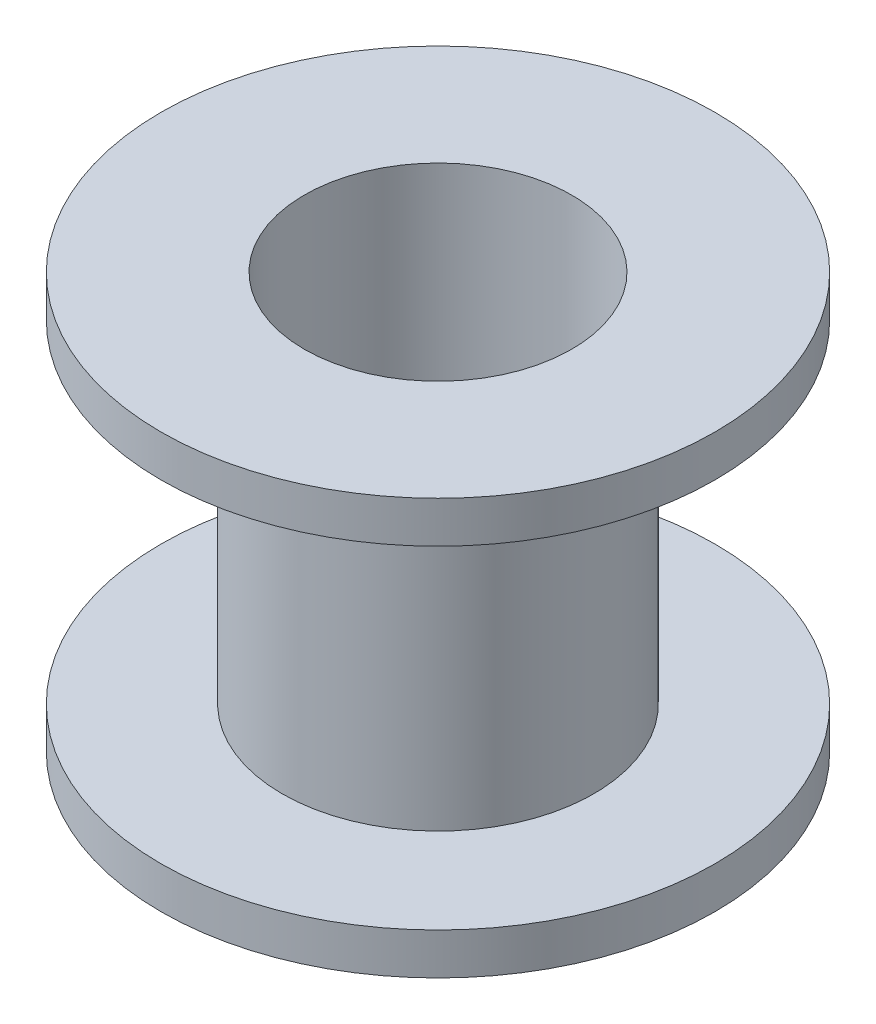
ISO-10303-21;
HEADER;
FILE_DESCRIPTION(('STEP AP214'),'2;1');
FILE_NAME('part.step','',(''),(''),'','','');
FILE_SCHEMA(('AUTOMOTIVE_DESIGN { 1 0 10303 214 1 1 1 1 }'));
ENDSEC;
DATA;
#1=APPLICATION_CONTEXT('core data for automotive mechanical design processes');
#2=APPLICATION_PROTOCOL_DEFINITION('international standard','automotive_design',2000,#1);
#3=PRODUCT_CONTEXT('',#1,'mechanical');
#4=PRODUCT('Part','Part','',(#3));
#5=PRODUCT_RELATED_PRODUCT_CATEGORY('part','',(#4));
#6=PRODUCT_DEFINITION_FORMATION('','',#4);
#7=PRODUCT_DEFINITION_CONTEXT('part definition',#1,'design');
#8=PRODUCT_DEFINITION('design','',#6,#7);
#9=PRODUCT_DEFINITION_SHAPE('','',#8);
#10=(LENGTH_UNIT() NAMED_UNIT(*) SI_UNIT(.MILLI.,.METRE.));
#11=(NAMED_UNIT(*) PLANE_ANGLE_UNIT() SI_UNIT($,.RADIAN.));
#12=(NAMED_UNIT(*) SI_UNIT($,.STERADIAN.) SOLID_ANGLE_UNIT());
#13=UNCERTAINTY_MEASURE_WITH_UNIT(LENGTH_MEASURE(1.E-05),#10,'distance_accuracy_value','');
#14=(GEOMETRIC_REPRESENTATION_CONTEXT(3) GLOBAL_UNCERTAINTY_ASSIGNED_CONTEXT((#13)) GLOBAL_UNIT_ASSIGNED_CONTEXT((#10,
#11,#12)) REPRESENTATION_CONTEXT('',''));
#15=CARTESIAN_POINT('',(0.,0.,0.));
#16=DIRECTION('',(0.,0.,1.));
#17=DIRECTION('',(1.,0.,0.));
#18=AXIS2_PLACEMENT_3D('',#15,#16,#17);
#19=CARTESIAN_POINT('',(0.,7.5,0.));
#20=DIRECTION('',(0.,-1.,0.));
#21=DIRECTION('',(0.,0.,-1.));
#22=AXIS2_PLACEMENT_3D('',#19,#20,#21);
#23=CYLINDRICAL_SURFACE('',#22,5.626);
#24=CARTESIAN_POINT('',(0.,6.,0.));
#25=DIRECTION('',(0.,1.,0.));
#26=DIRECTION('',(0.,0.,1.));
#27=AXIS2_PLACEMENT_3D('',#24,#25,#26);
#28=CIRCLE('',#27,5.626);
#29=CARTESIAN_POINT('',(0.,6.,5.626));
#30=VERTEX_POINT('',#29);
#31=EDGE_CURVE('E52',#30,#30,#28,.T.);
#32=ORIENTED_EDGE('',*,*,#31,.F.);
#33=EDGE_LOOP('',(#32));
#34=FACE_BOUND('',#33,.T.);
#35=CARTESIAN_POINT('',(0.,-6.,0.));
#36=DIRECTION('',(0.,-1.,0.));
#37=DIRECTION('',(0.,0.,-1.));
#38=AXIS2_PLACEMENT_3D('',#35,#36,#37);
#39=CIRCLE('',#38,5.626);
#40=CARTESIAN_POINT('',(0.,-6.,-5.626));
#41=VERTEX_POINT('',#40);
#42=EDGE_CURVE('E10',#41,#41,#39,.T.);
#43=ORIENTED_EDGE('',*,*,#42,.F.);
#44=EDGE_LOOP('',(#43));
#45=FACE_BOUND('',#44,.T.);
#46=ADVANCED_FACE('F45',(#34,#45),#23,.T.);
#47=CARTESIAN_POINT('',(0.,7.5,0.));
#48=DIRECTION('',(0.,1.,0.));
#49=DIRECTION('',(0.,0.,1.));
#50=AXIS2_PLACEMENT_3D('',#47,#48,#49);
#51=PLANE('',#50);
#52=CARTESIAN_POINT('',(0.,7.5,0.));
#53=DIRECTION('',(0.,1.,0.));
#54=DIRECTION('',(0.,0.,1.));
#55=AXIS2_PLACEMENT_3D('',#52,#53,#54);
#56=CIRCLE('',#55,4.826);
#57=CARTESIAN_POINT('',(0.,7.5,4.826));
#58=VERTEX_POINT('',#57);
#59=EDGE_CURVE('E57',#58,#58,#56,.T.);
#60=ORIENTED_EDGE('',*,*,#59,.F.);
#61=EDGE_LOOP('',(#60));
#62=FACE_BOUND('',#61,.T.);
#63=CARTESIAN_POINT('',(0.,7.5,0.));
#64=DIRECTION('',(0.,1.,0.));
#65=DIRECTION('',(0.,0.,1.));
#66=AXIS2_PLACEMENT_3D('',#63,#64,#65);
#67=CIRCLE('',#66,10.);
#68=CARTESIAN_POINT('',(0.,7.5,10.));
#69=VERTEX_POINT('',#68);
#70=EDGE_CURVE('E69',#69,#69,#67,.T.);
#71=ORIENTED_EDGE('',*,*,#70,.T.);
#72=EDGE_LOOP('',(#71));
#73=FACE_BOUND('',#72,.T.);
#74=ADVANCED_FACE('F97',(#62,#73),#51,.T.);
#75=CARTESIAN_POINT('',(0.,-7.5,0.));
#76=DIRECTION('',(0.,1.,0.));
#77=DIRECTION('',(0.,0.,1.));
#78=AXIS2_PLACEMENT_3D('',#75,#76,#77);
#79=PLANE('',#78);
#80=CARTESIAN_POINT('',(0.,-7.5,0.));
#81=DIRECTION('',(0.,1.,0.));
#82=DIRECTION('',(0.,0.,1.));
#83=AXIS2_PLACEMENT_3D('',#80,#81,#82);
#84=CIRCLE('',#83,4.826);
#85=CARTESIAN_POINT('',(0.,-7.5,4.826));
#86=VERTEX_POINT('',#85);
#87=EDGE_CURVE('E62',#86,#86,#84,.T.);
#88=ORIENTED_EDGE('',*,*,#87,.T.);
#89=EDGE_LOOP('',(#88));
#90=FACE_BOUND('',#89,.T.);
#91=CARTESIAN_POINT('',(0.,-7.5,0.));
#92=DIRECTION('',(0.,1.,0.));
#93=DIRECTION('',(0.,0.,1.));
#94=AXIS2_PLACEMENT_3D('',#91,#92,#93);
#95=CIRCLE('',#94,10.);
#96=CARTESIAN_POINT('',(0.,-7.5,10.));
#97=VERTEX_POINT('',#96);
#98=EDGE_CURVE('E77',#97,#97,#95,.T.);
#99=ORIENTED_EDGE('',*,*,#98,.F.);
#100=EDGE_LOOP('',(#99));
#101=FACE_BOUND('',#100,.T.);
#102=ADVANCED_FACE('F94',(#90,#101),#79,.F.);
#103=CARTESIAN_POINT('',(0.,7.5,0.));
#104=DIRECTION('',(0.,-1.,0.));
#105=DIRECTION('',(0.,0.,-1.));
#106=AXIS2_PLACEMENT_3D('',#103,#104,#105);
#107=CYLINDRICAL_SURFACE('',#106,4.826);
#108=ORIENTED_EDGE('',*,*,#59,.T.);
#109=EDGE_LOOP('',(#108));
#110=FACE_BOUND('',#109,.T.);
#111=ORIENTED_EDGE('',*,*,#87,.F.);
#112=EDGE_LOOP('',(#111));
#113=FACE_BOUND('',#112,.T.);
#114=ADVANCED_FACE('F96',(#110,#113),#107,.F.);
#115=CARTESIAN_POINT('',(0.,6.,0.));
#116=DIRECTION('',(0.,1.,0.));
#117=DIRECTION('',(0.,0.,1.));
#118=AXIS2_PLACEMENT_3D('',#115,#116,#117);
#119=CYLINDRICAL_SURFACE('',#118,10.);
#120=CARTESIAN_POINT('',(0.,6.,0.));
#121=DIRECTION('',(0.,1.,0.));
#122=DIRECTION('',(0.,0.,1.));
#123=AXIS2_PLACEMENT_3D('',#120,#121,#122);
#124=CIRCLE('',#123,10.);
#125=CARTESIAN_POINT('',(0.,6.,10.));
#126=VERTEX_POINT('',#125);
#127=EDGE_CURVE('E67',#126,#126,#124,.T.);
#128=ORIENTED_EDGE('',*,*,#127,.T.);
#129=EDGE_LOOP('',(#128));
#130=FACE_BOUND('',#129,.T.);
#131=ORIENTED_EDGE('',*,*,#70,.F.);
#132=EDGE_LOOP('',(#131));
#133=FACE_BOUND('',#132,.T.);
#134=ADVANCED_FACE('F103',(#130,#133),#119,.T.);
#135=CARTESIAN_POINT('',(0.,6.,0.));
#136=DIRECTION('',(0.,1.,0.));
#137=DIRECTION('',(0.,0.,1.));
#138=AXIS2_PLACEMENT_3D('',#135,#136,#137);
#139=PLANE('',#138);
#140=ORIENTED_EDGE('',*,*,#31,.T.);
#141=EDGE_LOOP('',(#140));
#142=FACE_BOUND('',#141,.T.);
#143=ORIENTED_EDGE('',*,*,#127,.F.);
#144=EDGE_LOOP('',(#143));
#145=FACE_BOUND('',#144,.T.);
#146=ADVANCED_FACE('F90',(#142,#145),#139,.F.);
#147=CARTESIAN_POINT('',(0.,-6.,0.));
#148=DIRECTION('',(0.,-1.,0.));
#149=DIRECTION('',(0.,0.,-1.));
#150=AXIS2_PLACEMENT_3D('',#147,#148,#149);
#151=CYLINDRICAL_SURFACE('',#150,10.);
#152=CARTESIAN_POINT('',(0.,-6.,0.));
#153=DIRECTION('',(0.,1.,0.));
#154=DIRECTION('',(0.,0.,1.));
#155=AXIS2_PLACEMENT_3D('',#152,#153,#154);
#156=CIRCLE('',#155,10.);
#157=CARTESIAN_POINT('',(0.,-6.,10.));
#158=VERTEX_POINT('',#157);
#159=EDGE_CURVE('E73',#158,#158,#156,.T.);
#160=ORIENTED_EDGE('',*,*,#159,.F.);
#161=EDGE_LOOP('',(#160));
#162=FACE_BOUND('',#161,.T.);
#163=ORIENTED_EDGE('',*,*,#98,.T.);
#164=EDGE_LOOP('',(#163));
#165=FACE_BOUND('',#164,.T.);
#166=ADVANCED_FACE('F87',(#162,#165),#151,.T.);
#167=CARTESIAN_POINT('',(0.,-6.,0.));
#168=DIRECTION('',(0.,-1.,0.));
#169=DIRECTION('',(0.,0.,1.));
#170=AXIS2_PLACEMENT_3D('',#167,#168,#169);
#171=PLANE('',#170);
#172=ORIENTED_EDGE('',*,*,#42,.T.);
#173=EDGE_LOOP('',(#172));
#174=FACE_BOUND('',#173,.T.);
#175=ORIENTED_EDGE('',*,*,#159,.T.);
#176=EDGE_LOOP('',(#175));
#177=FACE_BOUND('',#176,.T.);
#178=ADVANCED_FACE('F85',(#174,#177),#171,.F.);
#179=CLOSED_SHELL('',(#46,#74,#102,#114,#134,#146,#166,#178));
#180=MANIFOLD_SOLID_BREP('B2',#179);
#181=ADVANCED_BREP_SHAPE_REPRESENTATION('',(#18,#180),#14);
#182=SHAPE_DEFINITION_REPRESENTATION(#9,#181);
ENDSEC;
END-ISO-10303-21;
